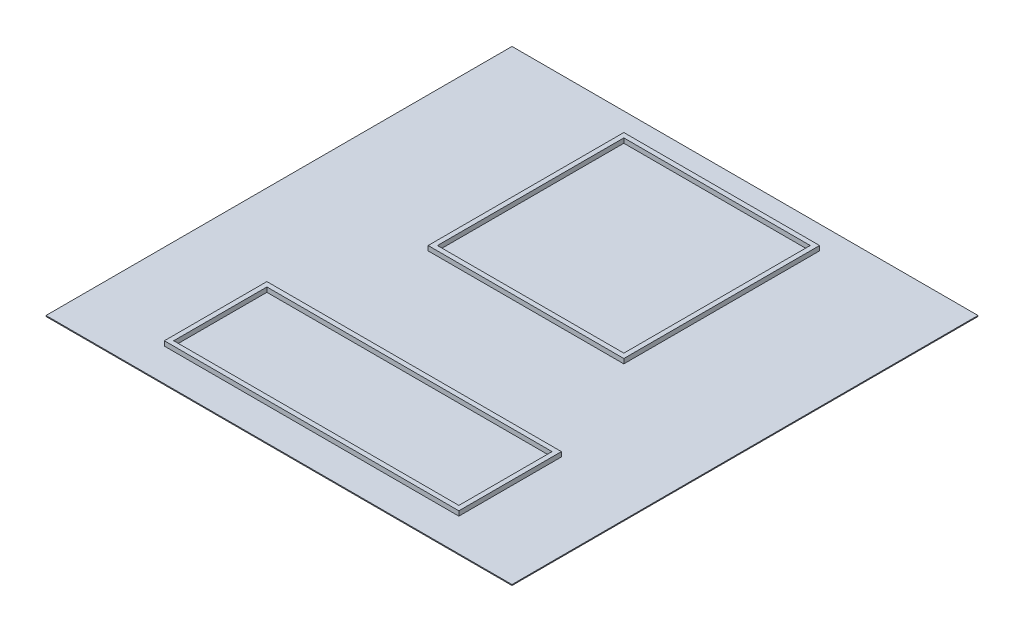
ISO-10303-21;
HEADER;
FILE_DESCRIPTION(('STEP AP214'),'2;1');
FILE_NAME('part.step','',(''),(''),'','','');
FILE_SCHEMA(('AUTOMOTIVE_DESIGN { 1 0 10303 214 1 1 1 1 }'));
ENDSEC;
DATA;
#1=APPLICATION_CONTEXT('core data for automotive mechanical design processes');
#2=APPLICATION_PROTOCOL_DEFINITION('international standard','automotive_design',2000,#1);
#3=PRODUCT_CONTEXT('',#1,'mechanical');
#4=PRODUCT('Part','Part','',(#3));
#5=PRODUCT_RELATED_PRODUCT_CATEGORY('part','',(#4));
#6=PRODUCT_DEFINITION_FORMATION('','',#4);
#7=PRODUCT_DEFINITION_CONTEXT('part definition',#1,'design');
#8=PRODUCT_DEFINITION('design','',#6,#7);
#9=PRODUCT_DEFINITION_SHAPE('','',#8);
#10=(LENGTH_UNIT() NAMED_UNIT(*) SI_UNIT(.MILLI.,.METRE.));
#11=(NAMED_UNIT(*) PLANE_ANGLE_UNIT() SI_UNIT($,.RADIAN.));
#12=(NAMED_UNIT(*) SI_UNIT($,.STERADIAN.) SOLID_ANGLE_UNIT());
#13=UNCERTAINTY_MEASURE_WITH_UNIT(LENGTH_MEASURE(1.E-05),#10,'distance_accuracy_value','');
#14=(GEOMETRIC_REPRESENTATION_CONTEXT(3) GLOBAL_UNCERTAINTY_ASSIGNED_CONTEXT((#13)) GLOBAL_UNIT_ASSIGNED_CONTEXT((#10,
#11,#12)) REPRESENTATION_CONTEXT('',''));
#15=CARTESIAN_POINT('',(0.,0.,0.));
#16=DIRECTION('',(0.,0.,1.));
#17=DIRECTION('',(1.,0.,0.));
#18=AXIS2_PLACEMENT_3D('',#15,#16,#17);
#19=CARTESIAN_POINT('',(0.,10.,0.));
#20=DIRECTION('',(0.,1.,0.));
#21=DIRECTION('',(0.,0.,1.));
#22=AXIS2_PLACEMENT_3D('',#19,#20,#21);
#23=PLANE('',#22);
#24=DIRECTION('',(0.,0.,1.));
#25=VECTOR('',#24,1.);
#26=CARTESIAN_POINT('',(1450.,10.,250.));
#27=LINE('',#26,#25);
#28=CARTESIAN_POINT('',(1450.,10.,250.));
#29=VERTEX_POINT('',#28);
#30=CARTESIAN_POINT('',(1450.,10.,2350.));
#31=VERTEX_POINT('',#30);
#32=EDGE_CURVE('E280',#29,#31,#27,.T.);
#33=ORIENTED_EDGE('',*,*,#32,.F.);
#34=DIRECTION('',(-1.,0.,0.));
#35=VECTOR('',#34,1.);
#36=CARTESIAN_POINT('',(1450.,10.,250.));
#37=LINE('',#36,#35);
#38=CARTESIAN_POINT('',(3550.,10.,250.));
#39=VERTEX_POINT('',#38);
#40=EDGE_CURVE('E266',#39,#29,#37,.T.);
#41=ORIENTED_EDGE('',*,*,#40,.F.);
#42=DIRECTION('',(0.,0.,-1.));
#43=VECTOR('',#42,1.);
#44=CARTESIAN_POINT('',(3550.,10.,250.));
#45=LINE('',#44,#43);
#46=CARTESIAN_POINT('',(3550.,10.,2350.));
#47=VERTEX_POINT('',#46);
#48=EDGE_CURVE('E271',#47,#39,#45,.T.);
#49=ORIENTED_EDGE('',*,*,#48,.F.);
#50=DIRECTION('',(1.,0.,0.));
#51=VECTOR('',#50,1.);
#52=CARTESIAN_POINT('',(1450.,10.,2350.));
#53=LINE('',#52,#51);
#54=EDGE_CURVE('E282',#31,#47,#53,.T.);
#55=ORIENTED_EDGE('',*,*,#54,.F.);
#56=EDGE_LOOP('',(#33,#41,#49,#55));
#57=FACE_BOUND('',#56,.T.);
#58=DIRECTION('',(0.,0.,1.));
#59=VECTOR('',#58,1.);
#60=CARTESIAN_POINT('',(0.,10.,0.));
#61=LINE('',#60,#59);
#62=CARTESIAN_POINT('',(0.,10.,0.));
#63=VERTEX_POINT('',#62);
#64=CARTESIAN_POINT('',(6.12323399573677E-13,10.,5000.));
#65=VERTEX_POINT('',#64);
#66=EDGE_CURVE('E296',#63,#65,#61,.T.);
#67=ORIENTED_EDGE('',*,*,#66,.T.);
#68=DIRECTION('',(1.,0.,0.));
#69=VECTOR('',#68,1.);
#70=CARTESIAN_POINT('',(6.12323399573677E-13,10.,5000.));
#71=LINE('',#70,#69);
#72=CARTESIAN_POINT('',(5000.,10.,5000.));
#73=VERTEX_POINT('',#72);
#74=EDGE_CURVE('E299',#65,#73,#71,.T.);
#75=ORIENTED_EDGE('',*,*,#74,.T.);
#76=DIRECTION('',(0.,0.,-1.));
#77=VECTOR('',#76,1.);
#78=CARTESIAN_POINT('',(5000.,10.,0.));
#79=LINE('',#78,#77);
#80=CARTESIAN_POINT('',(5000.,10.,0.));
#81=VERTEX_POINT('',#80);
#82=EDGE_CURVE('E302',#73,#81,#79,.T.);
#83=ORIENTED_EDGE('',*,*,#82,.T.);
#84=DIRECTION('',(-1.,0.,0.));
#85=VECTOR('',#84,1.);
#86=CARTESIAN_POINT('',(0.,10.,0.));
#87=LINE('',#86,#85);
#88=EDGE_CURVE('E304',#81,#63,#87,.T.);
#89=ORIENTED_EDGE('',*,*,#88,.T.);
#90=EDGE_LOOP('',(#67,#75,#83,#89));
#91=FACE_BOUND('',#90,.T.);
#92=DIRECTION('',(1.,0.,0.));
#93=VECTOR('',#92,1.);
#94=CARTESIAN_POINT('',(920.,10.,4650.));
#95=LINE('',#94,#93);
#96=CARTESIAN_POINT('',(920.,10.,4650.));
#97=VERTEX_POINT('',#96);
#98=CARTESIAN_POINT('',(4080.,10.,4650.));
#99=VERTEX_POINT('',#98);
#100=EDGE_CURVE('E224',#97,#99,#95,.T.);
#101=ORIENTED_EDGE('',*,*,#100,.F.);
#102=DIRECTION('',(0.,0.,1.));
#103=VECTOR('',#102,1.);
#104=CARTESIAN_POINT('',(920.,10.,3550.));
#105=LINE('',#104,#103);
#106=CARTESIAN_POINT('',(920.,10.,3550.));
#107=VERTEX_POINT('',#106);
#108=EDGE_CURVE('E189',#107,#97,#105,.T.);
#109=ORIENTED_EDGE('',*,*,#108,.F.);
#110=DIRECTION('',(-1.,0.,0.));
#111=VECTOR('',#110,1.);
#112=CARTESIAN_POINT('',(920.,10.,3550.));
#113=LINE('',#112,#111);
#114=CARTESIAN_POINT('',(4080.,10.,3550.));
#115=VERTEX_POINT('',#114);
#116=EDGE_CURVE('E215',#115,#107,#113,.T.);
#117=ORIENTED_EDGE('',*,*,#116,.F.);
#118=DIRECTION('',(0.,0.,-1.));
#119=VECTOR('',#118,1.);
#120=CARTESIAN_POINT('',(4080.,10.,3550.));
#121=LINE('',#120,#119);
#122=EDGE_CURVE('E226',#99,#115,#121,.T.);
#123=ORIENTED_EDGE('',*,*,#122,.F.);
#124=EDGE_LOOP('',(#101,#109,#117,#123));
#125=FACE_BOUND('',#124,.T.);
#126=ADVANCED_FACE('F33',(#57,#91,#125),#23,.T.);
#127=CARTESIAN_POINT('',(0.,10.,0.));
#128=DIRECTION('',(1.,0.,0.));
#129=DIRECTION('',(0.,0.,-1.));
#130=AXIS2_PLACEMENT_3D('',#127,#128,#129);
#131=PLANE('',#130);
#132=DIRECTION('',(0.,0.,1.));
#133=VECTOR('',#132,1.);
#134=CARTESIAN_POINT('',(0.,0.,0.));
#135=LINE('',#134,#133);
#136=CARTESIAN_POINT('',(0.,0.,0.));
#137=VERTEX_POINT('',#136);
#138=CARTESIAN_POINT('',(6.12323399573677E-13,0.,5000.));
#139=VERTEX_POINT('',#138);
#140=EDGE_CURVE('E295',#137,#139,#135,.T.);
#141=ORIENTED_EDGE('',*,*,#140,.T.);
#142=DIRECTION('',(0.,-1.,0.));
#143=VECTOR('',#142,1.);
#144=CARTESIAN_POINT('',(6.12323399573677E-13,10.,5000.));
#145=LINE('',#144,#143);
#146=EDGE_CURVE('E11',#65,#139,#145,.T.);
#147=ORIENTED_EDGE('',*,*,#146,.F.);
#148=ORIENTED_EDGE('',*,*,#66,.F.);
#149=DIRECTION('',(0.,-1.,0.));
#150=VECTOR('',#149,1.);
#151=CARTESIAN_POINT('',(0.,10.,0.));
#152=LINE('',#151,#150);
#153=EDGE_CURVE('E306',#63,#137,#152,.T.);
#154=ORIENTED_EDGE('',*,*,#153,.T.);
#155=EDGE_LOOP('',(#141,#147,#148,#154));
#156=FACE_BOUND('',#155,.T.);
#157=ADVANCED_FACE('F35',(#156),#131,.F.);
#158=CARTESIAN_POINT('',(6.12323399573677E-13,10.,5000.));
#159=DIRECTION('',(0.,0.,-1.));
#160=DIRECTION('',(-1.,0.,0.));
#161=AXIS2_PLACEMENT_3D('',#158,#159,#160);
#162=PLANE('',#161);
#163=DIRECTION('',(1.,0.,0.));
#164=VECTOR('',#163,1.);
#165=CARTESIAN_POINT('',(6.12323399573677E-13,0.,5000.));
#166=LINE('',#165,#164);
#167=CARTESIAN_POINT('',(5000.,0.,5000.));
#168=VERTEX_POINT('',#167);
#169=EDGE_CURVE('E309',#139,#168,#166,.T.);
#170=ORIENTED_EDGE('',*,*,#169,.T.);
#171=DIRECTION('',(0.,-1.,0.));
#172=VECTOR('',#171,1.);
#173=CARTESIAN_POINT('',(5000.,10.,5000.));
#174=LINE('',#173,#172);
#175=EDGE_CURVE('E41',#73,#168,#174,.T.);
#176=ORIENTED_EDGE('',*,*,#175,.F.);
#177=ORIENTED_EDGE('',*,*,#74,.F.);
#178=ORIENTED_EDGE('',*,*,#146,.T.);
#179=EDGE_LOOP('',(#170,#176,#177,#178));
#180=FACE_BOUND('',#179,.T.);
#181=ADVANCED_FACE('F339',(#180),#162,.F.);
#182=CARTESIAN_POINT('',(5000.,10.,0.));
#183=DIRECTION('',(-1.,0.,0.));
#184=DIRECTION('',(0.,0.,1.));
#185=AXIS2_PLACEMENT_3D('',#182,#183,#184);
#186=PLANE('',#185);
#187=DIRECTION('',(0.,0.,-1.));
#188=VECTOR('',#187,1.);
#189=CARTESIAN_POINT('',(5000.,0.,0.));
#190=LINE('',#189,#188);
#191=CARTESIAN_POINT('',(5000.,0.,0.));
#192=VERTEX_POINT('',#191);
#193=EDGE_CURVE('E311',#168,#192,#190,.T.);
#194=ORIENTED_EDGE('',*,*,#193,.T.);
#195=DIRECTION('',(0.,-1.,0.));
#196=VECTOR('',#195,1.);
#197=CARTESIAN_POINT('',(5000.,10.,0.));
#198=LINE('',#197,#196);
#199=EDGE_CURVE('E316',#81,#192,#198,.T.);
#200=ORIENTED_EDGE('',*,*,#199,.F.);
#201=ORIENTED_EDGE('',*,*,#82,.F.);
#202=ORIENTED_EDGE('',*,*,#175,.T.);
#203=EDGE_LOOP('',(#194,#200,#201,#202));
#204=FACE_BOUND('',#203,.T.);
#205=ADVANCED_FACE('F323',(#204),#186,.F.);
#206=CARTESIAN_POINT('',(0.,10.,0.));
#207=DIRECTION('',(0.,0.,1.));
#208=DIRECTION('',(1.,0.,0.));
#209=AXIS2_PLACEMENT_3D('',#206,#207,#208);
#210=PLANE('',#209);
#211=DIRECTION('',(-1.,0.,0.));
#212=VECTOR('',#211,1.);
#213=CARTESIAN_POINT('',(0.,0.,0.));
#214=LINE('',#213,#212);
#215=EDGE_CURVE('E300',#192,#137,#214,.T.);
#216=ORIENTED_EDGE('',*,*,#215,.T.);
#217=ORIENTED_EDGE('',*,*,#153,.F.);
#218=ORIENTED_EDGE('',*,*,#88,.F.);
#219=ORIENTED_EDGE('',*,*,#199,.T.);
#220=EDGE_LOOP('',(#216,#217,#218,#219));
#221=FACE_BOUND('',#220,.T.);
#222=ADVANCED_FACE('F332',(#221),#210,.F.);
#223=CARTESIAN_POINT('',(0.,0.,0.));
#224=DIRECTION('',(0.,1.,0.));
#225=DIRECTION('',(0.,0.,1.));
#226=AXIS2_PLACEMENT_3D('',#223,#224,#225);
#227=PLANE('',#226);
#228=ORIENTED_EDGE('',*,*,#140,.F.);
#229=ORIENTED_EDGE('',*,*,#215,.F.);
#230=ORIENTED_EDGE('',*,*,#193,.F.);
#231=ORIENTED_EDGE('',*,*,#169,.F.);
#232=EDGE_LOOP('',(#228,#229,#230,#231));
#233=FACE_BOUND('',#232,.T.);
#234=ADVANCED_FACE('F329',(#233),#227,.F.);
#235=CARTESIAN_POINT('',(0.,60.,0.));
#236=DIRECTION('',(0.,-1.,0.));
#237=DIRECTION('',(0.,0.,-1.));
#238=AXIS2_PLACEMENT_3D('',#235,#236,#237);
#239=PLANE('',#238);
#240=DIRECTION('',(-1.,0.,0.));
#241=VECTOR('',#240,1.);
#242=CARTESIAN_POINT('',(1450.,60.,250.));
#243=LINE('',#242,#241);
#244=CARTESIAN_POINT('',(3550.,60.,250.));
#245=VERTEX_POINT('',#244);
#246=CARTESIAN_POINT('',(1450.,60.,250.));
#247=VERTEX_POINT('',#246);
#248=EDGE_CURVE('E267',#245,#247,#243,.T.);
#249=ORIENTED_EDGE('',*,*,#248,.T.);
#250=DIRECTION('',(0.,0.,1.));
#251=VECTOR('',#250,1.);
#252=CARTESIAN_POINT('',(1450.,60.,250.));
#253=LINE('',#252,#251);
#254=CARTESIAN_POINT('',(1450.,60.,2350.));
#255=VERTEX_POINT('',#254);
#256=EDGE_CURVE('E270',#247,#255,#253,.T.);
#257=ORIENTED_EDGE('',*,*,#256,.T.);
#258=DIRECTION('',(1.,0.,0.));
#259=VECTOR('',#258,1.);
#260=CARTESIAN_POINT('',(1450.,60.,2350.));
#261=LINE('',#260,#259);
#262=CARTESIAN_POINT('',(3550.,60.,2350.));
#263=VERTEX_POINT('',#262);
#264=EDGE_CURVE('E273',#255,#263,#261,.T.);
#265=ORIENTED_EDGE('',*,*,#264,.T.);
#266=DIRECTION('',(0.,0.,-1.));
#267=VECTOR('',#266,1.);
#268=CARTESIAN_POINT('',(3550.,60.,250.));
#269=LINE('',#268,#267);
#270=EDGE_CURVE('E275',#263,#245,#269,.T.);
#271=ORIENTED_EDGE('',*,*,#270,.T.);
#272=EDGE_LOOP('',(#249,#257,#265,#271));
#273=FACE_BOUND('',#272,.T.);
#274=DIRECTION('',(0.,0.,1.));
#275=VECTOR('',#274,1.);
#276=CARTESIAN_POINT('',(1500.,60.,300.));
#277=LINE('',#276,#275);
#278=CARTESIAN_POINT('',(1500.,60.,300.));
#279=VERTEX_POINT('',#278);
#280=CARTESIAN_POINT('',(1500.,60.,2300.));
#281=VERTEX_POINT('',#280);
#282=EDGE_CURVE('E238',#279,#281,#277,.T.);
#283=ORIENTED_EDGE('',*,*,#282,.F.);
#284=DIRECTION('',(-1.,0.,0.));
#285=VECTOR('',#284,1.);
#286=CARTESIAN_POINT('',(1500.,60.,300.));
#287=LINE('',#286,#285);
#288=CARTESIAN_POINT('',(3500.,60.,300.));
#289=VERTEX_POINT('',#288);
#290=EDGE_CURVE('E246',#289,#279,#287,.T.);
#291=ORIENTED_EDGE('',*,*,#290,.F.);
#292=DIRECTION('',(0.,0.,-1.));
#293=VECTOR('',#292,1.);
#294=CARTESIAN_POINT('',(3500.,60.,300.));
#295=LINE('',#294,#293);
#296=CARTESIAN_POINT('',(3500.,60.,2300.));
#297=VERTEX_POINT('',#296);
#298=EDGE_CURVE('E243',#297,#289,#295,.T.);
#299=ORIENTED_EDGE('',*,*,#298,.F.);
#300=DIRECTION('',(1.,0.,0.));
#301=VECTOR('',#300,1.);
#302=CARTESIAN_POINT('',(1500.,60.,2300.));
#303=LINE('',#302,#301);
#304=EDGE_CURVE('E240',#281,#297,#303,.T.);
#305=ORIENTED_EDGE('',*,*,#304,.F.);
#306=EDGE_LOOP('',(#283,#291,#299,#305));
#307=FACE_BOUND('',#306,.T.);
#308=ADVANCED_FACE('F386',(#273,#307),#239,.F.);
#309=CARTESIAN_POINT('',(1450.,60.,250.));
#310=DIRECTION('',(0.,0.,1.));
#311=DIRECTION('',(1.,0.,0.));
#312=AXIS2_PLACEMENT_3D('',#309,#310,#311);
#313=PLANE('',#312);
#314=ORIENTED_EDGE('',*,*,#40,.T.);
#315=DIRECTION('',(0.,-1.,0.));
#316=VECTOR('',#315,1.);
#317=CARTESIAN_POINT('',(1450.,60.,250.));
#318=LINE('',#317,#316);
#319=EDGE_CURVE('E293',#247,#29,#318,.T.);
#320=ORIENTED_EDGE('',*,*,#319,.F.);
#321=ORIENTED_EDGE('',*,*,#248,.F.);
#322=DIRECTION('',(0.,-1.,0.));
#323=VECTOR('',#322,1.);
#324=CARTESIAN_POINT('',(3550.,60.,250.));
#325=LINE('',#324,#323);
#326=EDGE_CURVE('E277',#245,#39,#325,.T.);
#327=ORIENTED_EDGE('',*,*,#326,.T.);
#328=EDGE_LOOP('',(#314,#320,#321,#327));
#329=FACE_BOUND('',#328,.T.);
#330=ADVANCED_FACE('F402',(#329),#313,.F.);
#331=CARTESIAN_POINT('',(1450.,60.,250.));
#332=DIRECTION('',(1.,0.,0.));
#333=DIRECTION('',(0.,0.,-1.));
#334=AXIS2_PLACEMENT_3D('',#331,#332,#333);
#335=PLANE('',#334);
#336=ORIENTED_EDGE('',*,*,#32,.T.);
#337=DIRECTION('',(0.,-1.,0.));
#338=VECTOR('',#337,1.);
#339=CARTESIAN_POINT('',(1450.,60.,2350.));
#340=LINE('',#339,#338);
#341=EDGE_CURVE('E290',#255,#31,#340,.T.);
#342=ORIENTED_EDGE('',*,*,#341,.F.);
#343=ORIENTED_EDGE('',*,*,#256,.F.);
#344=ORIENTED_EDGE('',*,*,#319,.T.);
#345=EDGE_LOOP('',(#336,#342,#343,#344));
#346=FACE_BOUND('',#345,.T.);
#347=ADVANCED_FACE('F410',(#346),#335,.F.);
#348=CARTESIAN_POINT('',(1450.,60.,2350.));
#349=DIRECTION('',(0.,0.,-1.));
#350=DIRECTION('',(-1.,0.,0.));
#351=AXIS2_PLACEMENT_3D('',#348,#349,#350);
#352=PLANE('',#351);
#353=ORIENTED_EDGE('',*,*,#54,.T.);
#354=DIRECTION('',(0.,-1.,0.));
#355=VECTOR('',#354,1.);
#356=CARTESIAN_POINT('',(3550.,60.,2350.));
#357=LINE('',#356,#355);
#358=EDGE_CURVE('E288',#263,#47,#357,.T.);
#359=ORIENTED_EDGE('',*,*,#358,.F.);
#360=ORIENTED_EDGE('',*,*,#264,.F.);
#361=ORIENTED_EDGE('',*,*,#341,.T.);
#362=EDGE_LOOP('',(#353,#359,#360,#361));
#363=FACE_BOUND('',#362,.T.);
#364=ADVANCED_FACE('F406',(#363),#352,.F.);
#365=CARTESIAN_POINT('',(3550.,60.,250.));
#366=DIRECTION('',(-1.,0.,0.));
#367=DIRECTION('',(0.,0.,1.));
#368=AXIS2_PLACEMENT_3D('',#365,#366,#367);
#369=PLANE('',#368);
#370=ORIENTED_EDGE('',*,*,#48,.T.);
#371=ORIENTED_EDGE('',*,*,#326,.F.);
#372=ORIENTED_EDGE('',*,*,#270,.F.);
#373=ORIENTED_EDGE('',*,*,#358,.T.);
#374=EDGE_LOOP('',(#370,#371,#372,#373));
#375=FACE_BOUND('',#374,.T.);
#376=ADVANCED_FACE('F399',(#375),#369,.F.);
#377=CARTESIAN_POINT('',(1500.,60.,300.));
#378=DIRECTION('',(1.,0.,0.));
#379=DIRECTION('',(0.,0.,-1.));
#380=AXIS2_PLACEMENT_3D('',#377,#378,#379);
#381=PLANE('',#380);
#382=DIRECTION('',(0.,0.,1.));
#383=VECTOR('',#382,1.);
#384=CARTESIAN_POINT('',(1500.,10.,300.));
#385=LINE('',#384,#383);
#386=CARTESIAN_POINT('',(1500.,10.,300.));
#387=VERTEX_POINT('',#386);
#388=CARTESIAN_POINT('',(1500.,10.,2300.));
#389=VERTEX_POINT('',#388);
#390=EDGE_CURVE('E237',#387,#389,#385,.T.);
#391=ORIENTED_EDGE('',*,*,#390,.F.);
#392=DIRECTION('',(0.,-1.,0.));
#393=VECTOR('',#392,1.);
#394=CARTESIAN_POINT('',(1500.,60.,300.));
#395=LINE('',#394,#393);
#396=EDGE_CURVE('E248',#279,#387,#395,.T.);
#397=ORIENTED_EDGE('',*,*,#396,.F.);
#398=ORIENTED_EDGE('',*,*,#282,.T.);
#399=DIRECTION('',(0.,-1.,0.));
#400=VECTOR('',#399,1.);
#401=CARTESIAN_POINT('',(1500.,60.,2300.));
#402=LINE('',#401,#400);
#403=EDGE_CURVE('E263',#281,#389,#402,.T.);
#404=ORIENTED_EDGE('',*,*,#403,.T.);
#405=EDGE_LOOP('',(#391,#397,#398,#404));
#406=FACE_BOUND('',#405,.T.);
#407=ADVANCED_FACE('F382',(#406),#381,.T.);
#408=CARTESIAN_POINT('',(1500.,60.,2300.));
#409=DIRECTION('',(0.,0.,-1.));
#410=DIRECTION('',(-1.,0.,0.));
#411=AXIS2_PLACEMENT_3D('',#408,#409,#410);
#412=PLANE('',#411);
#413=DIRECTION('',(1.,0.,0.));
#414=VECTOR('',#413,1.);
#415=CARTESIAN_POINT('',(1500.,10.,2300.));
#416=LINE('',#415,#414);
#417=CARTESIAN_POINT('',(3500.,10.,2300.));
#418=VERTEX_POINT('',#417);
#419=EDGE_CURVE('E250',#389,#418,#416,.T.);
#420=ORIENTED_EDGE('',*,*,#419,.F.);
#421=ORIENTED_EDGE('',*,*,#403,.F.);
#422=ORIENTED_EDGE('',*,*,#304,.T.);
#423=DIRECTION('',(0.,-1.,0.));
#424=VECTOR('',#423,1.);
#425=CARTESIAN_POINT('',(3500.,60.,2300.));
#426=LINE('',#425,#424);
#427=EDGE_CURVE('E260',#297,#418,#426,.T.);
#428=ORIENTED_EDGE('',*,*,#427,.T.);
#429=EDGE_LOOP('',(#420,#421,#422,#428));
#430=FACE_BOUND('',#429,.T.);
#431=ADVANCED_FACE('F378',(#430),#412,.T.);
#432=CARTESIAN_POINT('',(3500.,60.,300.));
#433=DIRECTION('',(-1.,0.,0.));
#434=DIRECTION('',(0.,0.,1.));
#435=AXIS2_PLACEMENT_3D('',#432,#433,#434);
#436=PLANE('',#435);
#437=DIRECTION('',(0.,0.,-1.));
#438=VECTOR('',#437,1.);
#439=CARTESIAN_POINT('',(3500.,10.,300.));
#440=LINE('',#439,#438);
#441=CARTESIAN_POINT('',(3500.,10.,300.));
#442=VERTEX_POINT('',#441);
#443=EDGE_CURVE('E252',#418,#442,#440,.T.);
#444=ORIENTED_EDGE('',*,*,#443,.F.);
#445=ORIENTED_EDGE('',*,*,#427,.F.);
#446=ORIENTED_EDGE('',*,*,#298,.T.);
#447=DIRECTION('',(0.,-1.,0.));
#448=VECTOR('',#447,1.);
#449=CARTESIAN_POINT('',(3500.,60.,300.));
#450=LINE('',#449,#448);
#451=EDGE_CURVE('E257',#289,#442,#450,.T.);
#452=ORIENTED_EDGE('',*,*,#451,.T.);
#453=EDGE_LOOP('',(#444,#445,#446,#452));
#454=FACE_BOUND('',#453,.T.);
#455=ADVANCED_FACE('F368',(#454),#436,.T.);
#456=CARTESIAN_POINT('',(1500.,60.,300.));
#457=DIRECTION('',(0.,0.,1.));
#458=DIRECTION('',(1.,0.,0.));
#459=AXIS2_PLACEMENT_3D('',#456,#457,#458);
#460=PLANE('',#459);
#461=DIRECTION('',(-1.,0.,0.));
#462=VECTOR('',#461,1.);
#463=CARTESIAN_POINT('',(1500.,10.,300.));
#464=LINE('',#463,#462);
#465=EDGE_CURVE('E241',#442,#387,#464,.T.);
#466=ORIENTED_EDGE('',*,*,#465,.F.);
#467=ORIENTED_EDGE('',*,*,#451,.F.);
#468=ORIENTED_EDGE('',*,*,#290,.T.);
#469=ORIENTED_EDGE('',*,*,#396,.T.);
#470=EDGE_LOOP('',(#466,#467,#468,#469));
#471=FACE_BOUND('',#470,.T.);
#472=ADVANCED_FACE('F359',(#471),#460,.T.);
#473=ORIENTED_EDGE('',*,*,#390,.T.);
#474=ORIENTED_EDGE('',*,*,#419,.T.);
#475=ORIENTED_EDGE('',*,*,#443,.T.);
#476=ORIENTED_EDGE('',*,*,#465,.T.);
#477=EDGE_LOOP('',(#473,#474,#475,#476));
#478=FACE_BOUND('',#477,.T.);
#479=ADVANCED_FACE('F350',(#478),#23,.T.);
#480=CARTESIAN_POINT('',(0.,60.,0.));
#481=DIRECTION('',(0.,1.,0.));
#482=DIRECTION('',(0.,0.,1.));
#483=AXIS2_PLACEMENT_3D('',#480,#481,#482);
#484=PLANE('',#483);
#485=DIRECTION('',(0.,0.,1.));
#486=VECTOR('',#485,1.);
#487=CARTESIAN_POINT('',(920.,60.,3550.));
#488=LINE('',#487,#486);
#489=CARTESIAN_POINT('',(920.,60.,3550.));
#490=VERTEX_POINT('',#489);
#491=CARTESIAN_POINT('',(920.,60.,4650.));
#492=VERTEX_POINT('',#491);
#493=EDGE_CURVE('E211',#490,#492,#488,.T.);
#494=ORIENTED_EDGE('',*,*,#493,.T.);
#495=DIRECTION('',(1.,0.,0.));
#496=VECTOR('',#495,1.);
#497=CARTESIAN_POINT('',(920.,60.,4650.));
#498=LINE('',#497,#496);
#499=CARTESIAN_POINT('',(4080.,60.,4650.));
#500=VERTEX_POINT('',#499);
#501=EDGE_CURVE('E214',#492,#500,#498,.T.);
#502=ORIENTED_EDGE('',*,*,#501,.T.);
#503=DIRECTION('',(0.,0.,-1.));
#504=VECTOR('',#503,1.);
#505=CARTESIAN_POINT('',(4080.,60.,3550.));
#506=LINE('',#505,#504);
#507=CARTESIAN_POINT('',(4080.,60.,3550.));
#508=VERTEX_POINT('',#507);
#509=EDGE_CURVE('E217',#500,#508,#506,.T.);
#510=ORIENTED_EDGE('',*,*,#509,.T.);
#511=DIRECTION('',(-1.,0.,0.));
#512=VECTOR('',#511,1.);
#513=CARTESIAN_POINT('',(920.,60.,3550.));
#514=LINE('',#513,#512);
#515=EDGE_CURVE('E219',#508,#490,#514,.T.);
#516=ORIENTED_EDGE('',*,*,#515,.T.);
#517=EDGE_LOOP('',(#494,#502,#510,#516));
#518=FACE_BOUND('',#517,.T.);
#519=DIRECTION('',(1.,0.,0.));
#520=VECTOR('',#519,1.);
#521=CARTESIAN_POINT('',(970.,60.,4600.));
#522=LINE('',#521,#520);
#523=CARTESIAN_POINT('',(970.,60.,4600.));
#524=VERTEX_POINT('',#523);
#525=CARTESIAN_POINT('',(4030.,60.,4600.));
#526=VERTEX_POINT('',#525);
#527=EDGE_CURVE('E181',#524,#526,#522,.T.);
#528=ORIENTED_EDGE('',*,*,#527,.F.);
#529=DIRECTION('',(0.,0.,1.));
#530=VECTOR('',#529,1.);
#531=CARTESIAN_POINT('',(970.,60.,3600.));
#532=LINE('',#531,#530);
#533=CARTESIAN_POINT('',(970.,60.,3600.));
#534=VERTEX_POINT('',#533);
#535=EDGE_CURVE('E172',#534,#524,#532,.T.);
#536=ORIENTED_EDGE('',*,*,#535,.F.);
#537=DIRECTION('',(-1.,0.,0.));
#538=VECTOR('',#537,1.);
#539=CARTESIAN_POINT('',(970.,60.,3600.));
#540=LINE('',#539,#538);
#541=CARTESIAN_POINT('',(4030.,60.,3600.));
#542=VERTEX_POINT('',#541);
#543=EDGE_CURVE('E197',#542,#534,#540,.T.);
#544=ORIENTED_EDGE('',*,*,#543,.F.);
#545=DIRECTION('',(0.,0.,-1.));
#546=VECTOR('',#545,1.);
#547=CARTESIAN_POINT('',(4030.,60.,3600.));
#548=LINE('',#547,#546);
#549=EDGE_CURVE('E195',#526,#542,#548,.T.);
#550=ORIENTED_EDGE('',*,*,#549,.F.);
#551=EDGE_LOOP('',(#528,#536,#544,#550));
#552=FACE_BOUND('',#551,.T.);
#553=ADVANCED_FACE('F193',(#518,#552),#484,.T.);
#554=CARTESIAN_POINT('',(920.,60.,3550.));
#555=DIRECTION('',(1.,0.,0.));
#556=DIRECTION('',(0.,0.,-1.));
#557=AXIS2_PLACEMENT_3D('',#554,#555,#556);
#558=PLANE('',#557);
#559=ORIENTED_EDGE('',*,*,#108,.T.);
#560=DIRECTION('',(0.,-1.,0.));
#561=VECTOR('',#560,1.);
#562=CARTESIAN_POINT('',(920.,60.,4650.));
#563=LINE('',#562,#561);
#564=EDGE_CURVE('E235',#492,#97,#563,.T.);
#565=ORIENTED_EDGE('',*,*,#564,.F.);
#566=ORIENTED_EDGE('',*,*,#493,.F.);
#567=DIRECTION('',(0.,-1.,0.));
#568=VECTOR('',#567,1.);
#569=CARTESIAN_POINT('',(920.,60.,3550.));
#570=LINE('',#569,#568);
#571=EDGE_CURVE('E221',#490,#107,#570,.T.);
#572=ORIENTED_EDGE('',*,*,#571,.T.);
#573=EDGE_LOOP('',(#559,#565,#566,#572));
#574=FACE_BOUND('',#573,.T.);
#575=ADVANCED_FACE('F365',(#574),#558,.F.);
#576=CARTESIAN_POINT('',(920.,60.,4650.));
#577=DIRECTION('',(0.,0.,-1.));
#578=DIRECTION('',(-1.,0.,0.));
#579=AXIS2_PLACEMENT_3D('',#576,#577,#578);
#580=PLANE('',#579);
#581=ORIENTED_EDGE('',*,*,#100,.T.);
#582=DIRECTION('',(0.,-1.,0.));
#583=VECTOR('',#582,1.);
#584=CARTESIAN_POINT('',(4080.,60.,4650.));
#585=LINE('',#584,#583);
#586=EDGE_CURVE('E232',#500,#99,#585,.T.);
#587=ORIENTED_EDGE('',*,*,#586,.F.);
#588=ORIENTED_EDGE('',*,*,#501,.F.);
#589=ORIENTED_EDGE('',*,*,#564,.T.);
#590=EDGE_LOOP('',(#581,#587,#588,#589));
#591=FACE_BOUND('',#590,.T.);
#592=ADVANCED_FACE('F482',(#591),#580,.F.);
#593=CARTESIAN_POINT('',(4080.,60.,3550.));
#594=DIRECTION('',(-1.,0.,0.));
#595=DIRECTION('',(0.,0.,1.));
#596=AXIS2_PLACEMENT_3D('',#593,#594,#595);
#597=PLANE('',#596);
#598=ORIENTED_EDGE('',*,*,#122,.T.);
#599=DIRECTION('',(0.,-1.,0.));
#600=VECTOR('',#599,1.);
#601=CARTESIAN_POINT('',(4080.,60.,3550.));
#602=LINE('',#601,#600);
#603=EDGE_CURVE('E48',#508,#115,#602,.T.);
#604=ORIENTED_EDGE('',*,*,#603,.F.);
#605=ORIENTED_EDGE('',*,*,#509,.F.);
#606=ORIENTED_EDGE('',*,*,#586,.T.);
#607=EDGE_LOOP('',(#598,#604,#605,#606));
#608=FACE_BOUND('',#607,.T.);
#609=ADVANCED_FACE('F491',(#608),#597,.F.);
#610=CARTESIAN_POINT('',(920.,60.,3550.));
#611=DIRECTION('',(0.,0.,1.));
#612=DIRECTION('',(1.,0.,0.));
#613=AXIS2_PLACEMENT_3D('',#610,#611,#612);
#614=PLANE('',#613);
#615=ORIENTED_EDGE('',*,*,#116,.T.);
#616=ORIENTED_EDGE('',*,*,#571,.F.);
#617=ORIENTED_EDGE('',*,*,#515,.F.);
#618=ORIENTED_EDGE('',*,*,#603,.T.);
#619=EDGE_LOOP('',(#615,#616,#617,#618));
#620=FACE_BOUND('',#619,.T.);
#621=ADVANCED_FACE('F501',(#620),#614,.F.);
#622=CARTESIAN_POINT('',(970.,60.,3600.));
#623=DIRECTION('',(1.,0.,0.));
#624=DIRECTION('',(0.,0.,-1.));
#625=AXIS2_PLACEMENT_3D('',#622,#623,#624);
#626=PLANE('',#625);
#627=DIRECTION('',(0.,0.,1.));
#628=VECTOR('',#627,1.);
#629=CARTESIAN_POINT('',(970.,10.,3600.));
#630=LINE('',#629,#628);
#631=CARTESIAN_POINT('',(970.,10.,3600.));
#632=VERTEX_POINT('',#631);
#633=CARTESIAN_POINT('',(970.,10.,4600.));
#634=VERTEX_POINT('',#633);
#635=EDGE_CURVE('E56',#632,#634,#630,.T.);
#636=ORIENTED_EDGE('',*,*,#635,.F.);
#637=DIRECTION('',(0.,-1.,0.));
#638=VECTOR('',#637,1.);
#639=CARTESIAN_POINT('',(970.,60.,3600.));
#640=LINE('',#639,#638);
#641=EDGE_CURVE('E177',#534,#632,#640,.T.);
#642=ORIENTED_EDGE('',*,*,#641,.F.);
#643=ORIENTED_EDGE('',*,*,#535,.T.);
#644=DIRECTION('',(0.,-1.,0.));
#645=VECTOR('',#644,1.);
#646=CARTESIAN_POINT('',(970.,60.,4600.));
#647=LINE('',#646,#645);
#648=EDGE_CURVE('E175',#524,#634,#647,.T.);
#649=ORIENTED_EDGE('',*,*,#648,.T.);
#650=EDGE_LOOP('',(#636,#642,#643,#649));
#651=FACE_BOUND('',#650,.T.);
#652=ADVANCED_FACE('F174',(#651),#626,.T.);
#653=CARTESIAN_POINT('',(970.,60.,4600.));
#654=DIRECTION('',(0.,0.,-1.));
#655=DIRECTION('',(-1.,0.,0.));
#656=AXIS2_PLACEMENT_3D('',#653,#654,#655);
#657=PLANE('',#656);
#658=DIRECTION('',(1.,0.,0.));
#659=VECTOR('',#658,1.);
#660=CARTESIAN_POINT('',(970.,10.,4600.));
#661=LINE('',#660,#659);
#662=CARTESIAN_POINT('',(4030.,10.,4600.));
#663=VERTEX_POINT('',#662);
#664=EDGE_CURVE('E188',#634,#663,#661,.T.);
#665=ORIENTED_EDGE('',*,*,#664,.F.);
#666=ORIENTED_EDGE('',*,*,#648,.F.);
#667=ORIENTED_EDGE('',*,*,#527,.T.);
#668=DIRECTION('',(0.,-1.,0.));
#669=VECTOR('',#668,1.);
#670=CARTESIAN_POINT('',(4030.,60.,4600.));
#671=LINE('',#670,#669);
#672=EDGE_CURVE('E190',#526,#663,#671,.T.);
#673=ORIENTED_EDGE('',*,*,#672,.T.);
#674=EDGE_LOOP('',(#665,#666,#667,#673));
#675=FACE_BOUND('',#674,.T.);
#676=ADVANCED_FACE('F185',(#675),#657,.T.);
#677=CARTESIAN_POINT('',(4030.,60.,3600.));
#678=DIRECTION('',(-1.,0.,0.));
#679=DIRECTION('',(0.,0.,1.));
#680=AXIS2_PLACEMENT_3D('',#677,#678,#679);
#681=PLANE('',#680);
#682=DIRECTION('',(0.,0.,-1.));
#683=VECTOR('',#682,1.);
#684=CARTESIAN_POINT('',(4030.,10.,3600.));
#685=LINE('',#684,#683);
#686=CARTESIAN_POINT('',(4030.,10.,3600.));
#687=VERTEX_POINT('',#686);
#688=EDGE_CURVE('E203',#663,#687,#685,.T.);
#689=ORIENTED_EDGE('',*,*,#688,.F.);
#690=ORIENTED_EDGE('',*,*,#672,.F.);
#691=ORIENTED_EDGE('',*,*,#549,.T.);
#692=DIRECTION('',(0.,-1.,0.));
#693=VECTOR('',#692,1.);
#694=CARTESIAN_POINT('',(4030.,60.,3600.));
#695=LINE('',#694,#693);
#696=EDGE_CURVE('E207',#542,#687,#695,.T.);
#697=ORIENTED_EDGE('',*,*,#696,.T.);
#698=EDGE_LOOP('',(#689,#690,#691,#697));
#699=FACE_BOUND('',#698,.T.);
#700=ADVANCED_FACE('F527',(#699),#681,.T.);
#701=CARTESIAN_POINT('',(970.,60.,3600.));
#702=DIRECTION('',(0.,0.,1.));
#703=DIRECTION('',(1.,0.,0.));
#704=AXIS2_PLACEMENT_3D('',#701,#702,#703);
#705=PLANE('',#704);
#706=DIRECTION('',(-1.,0.,0.));
#707=VECTOR('',#706,1.);
#708=CARTESIAN_POINT('',(970.,10.,3600.));
#709=LINE('',#708,#707);
#710=EDGE_CURVE('E182',#687,#632,#709,.T.);
#711=ORIENTED_EDGE('',*,*,#710,.F.);
#712=ORIENTED_EDGE('',*,*,#696,.F.);
#713=ORIENTED_EDGE('',*,*,#543,.T.);
#714=ORIENTED_EDGE('',*,*,#641,.T.);
#715=EDGE_LOOP('',(#711,#712,#713,#714));
#716=FACE_BOUND('',#715,.T.);
#717=ADVANCED_FACE('F357',(#716),#705,.T.);
#718=ORIENTED_EDGE('',*,*,#635,.T.);
#719=ORIENTED_EDGE('',*,*,#664,.T.);
#720=ORIENTED_EDGE('',*,*,#688,.T.);
#721=ORIENTED_EDGE('',*,*,#710,.T.);
#722=EDGE_LOOP('',(#718,#719,#720,#721));
#723=FACE_BOUND('',#722,.T.);
#724=ADVANCED_FACE('F349',(#723),#23,.T.);
#725=CLOSED_SHELL('',(#126,#157,#181,#205,#222,#234,#308,#330,#347,#364,#376,#407,#431,#455,
#472,#479,#553,#575,#592,#609,#621,#652,#676,#700,#717,#724));
#726=MANIFOLD_SOLID_BREP('B2',#725);
#727=ADVANCED_BREP_SHAPE_REPRESENTATION('',(#18,#726),#14);
#728=SHAPE_DEFINITION_REPRESENTATION(#9,#727);
ENDSEC;
END-ISO-10303-21;
